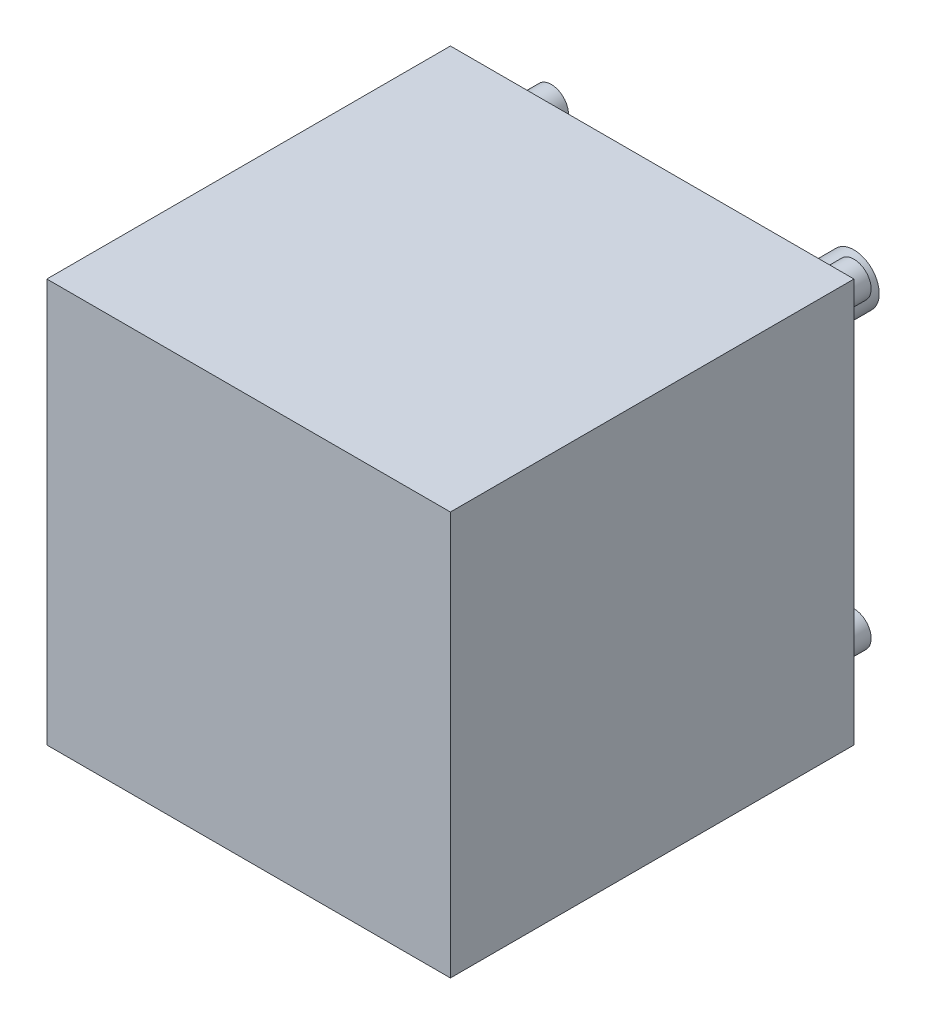
ISO-10303-21;
HEADER;
FILE_DESCRIPTION(('STEP AP214'),'2;1');
FILE_NAME('part.step','',(''),(''),'','','');
FILE_SCHEMA(('AUTOMOTIVE_DESIGN { 1 0 10303 214 1 1 1 1 }'));
ENDSEC;
DATA;
#1=APPLICATION_CONTEXT('core data for automotive mechanical design processes');
#2=APPLICATION_PROTOCOL_DEFINITION('international standard','automotive_design',2000,#1);
#3=PRODUCT_CONTEXT('',#1,'mechanical');
#4=PRODUCT('Part','Part','',(#3));
#5=PRODUCT_RELATED_PRODUCT_CATEGORY('part','',(#4));
#6=PRODUCT_DEFINITION_FORMATION('','',#4);
#7=PRODUCT_DEFINITION_CONTEXT('part definition',#1,'design');
#8=PRODUCT_DEFINITION('design','',#6,#7);
#9=PRODUCT_DEFINITION_SHAPE('','',#8);
#10=(LENGTH_UNIT() NAMED_UNIT(*) SI_UNIT(.MILLI.,.METRE.));
#11=(NAMED_UNIT(*) PLANE_ANGLE_UNIT() SI_UNIT($,.RADIAN.));
#12=(NAMED_UNIT(*) SI_UNIT($,.STERADIAN.) SOLID_ANGLE_UNIT());
#13=UNCERTAINTY_MEASURE_WITH_UNIT(LENGTH_MEASURE(1.E-05),#10,'distance_accuracy_value','');
#14=(GEOMETRIC_REPRESENTATION_CONTEXT(3) GLOBAL_UNCERTAINTY_ASSIGNED_CONTEXT((#13)) GLOBAL_UNIT_ASSIGNED_CONTEXT((#10,
#11,#12)) REPRESENTATION_CONTEXT('',''));
#15=CARTESIAN_POINT('',(0.,0.,0.));
#16=DIRECTION('',(0.,0.,1.));
#17=DIRECTION('',(1.,0.,0.));
#18=AXIS2_PLACEMENT_3D('',#15,#16,#17);
#19=CARTESIAN_POINT('',(20.,20.,0.));
#20=DIRECTION('',(0.,0.,-1.));
#21=DIRECTION('',(-1.,0.,0.));
#22=AXIS2_PLACEMENT_3D('',#19,#20,#21);
#23=PLANE('',#22);
#24=CARTESIAN_POINT('',(15.,15.,0.));
#25=DIRECTION('',(0.,0.,-1.));
#26=DIRECTION('',(1.,0.,0.));
#27=AXIS2_PLACEMENT_3D('',#24,#25,#26);
#28=CIRCLE('',#27,1.7);
#29=CARTESIAN_POINT('',(16.7,15.,0.));
#30=VERTEX_POINT('',#29);
#31=EDGE_CURVE('E138',#30,#30,#28,.T.);
#32=ORIENTED_EDGE('',*,*,#31,.F.);
#33=EDGE_LOOP('',(#32));
#34=FACE_BOUND('',#33,.T.);
#35=CARTESIAN_POINT('',(15.,-15.,0.));
#36=DIRECTION('',(0.,0.,-1.));
#37=DIRECTION('',(-1.,0.,0.));
#38=AXIS2_PLACEMENT_3D('',#35,#36,#37);
#39=CIRCLE('',#38,1.7);
#40=CARTESIAN_POINT('',(13.3,-15.,0.));
#41=VERTEX_POINT('',#40);
#42=EDGE_CURVE('E41',#41,#41,#39,.T.);
#43=ORIENTED_EDGE('',*,*,#42,.F.);
#44=EDGE_LOOP('',(#43));
#45=FACE_BOUND('',#44,.T.);
#46=DIRECTION('',(0.,1.,0.));
#47=VECTOR('',#46,1.);
#48=CARTESIAN_POINT('',(20.,-20.,0.));
#49=LINE('',#48,#47);
#50=CARTESIAN_POINT('',(20.,-20.,0.));
#51=VERTEX_POINT('',#50);
#52=CARTESIAN_POINT('',(20.,20.,0.));
#53=VERTEX_POINT('',#52);
#54=EDGE_CURVE('E100',#51,#53,#49,.T.);
#55=ORIENTED_EDGE('',*,*,#54,.F.);
#56=DIRECTION('',(1.,0.,0.));
#57=VECTOR('',#56,1.);
#58=CARTESIAN_POINT('',(-20.,-20.,0.));
#59=LINE('',#58,#57);
#60=CARTESIAN_POINT('',(-20.,-20.,0.));
#61=VERTEX_POINT('',#60);
#62=EDGE_CURVE('E72',#61,#51,#59,.T.);
#63=ORIENTED_EDGE('',*,*,#62,.F.);
#64=DIRECTION('',(0.,-1.,0.));
#65=VECTOR('',#64,1.);
#66=CARTESIAN_POINT('',(-20.,-20.,0.));
#67=LINE('',#66,#65);
#68=CARTESIAN_POINT('',(-20.,20.,0.));
#69=VERTEX_POINT('',#68);
#70=EDGE_CURVE('E66',#69,#61,#67,.T.);
#71=ORIENTED_EDGE('',*,*,#70,.F.);
#72=DIRECTION('',(-1.,0.,0.));
#73=VECTOR('',#72,1.);
#74=CARTESIAN_POINT('',(-20.,20.,0.));
#75=LINE('',#74,#73);
#76=EDGE_CURVE('E90',#53,#69,#75,.T.);
#77=ORIENTED_EDGE('',*,*,#76,.F.);
#78=EDGE_LOOP('',(#55,#63,#71,#77));
#79=FACE_BOUND('',#78,.T.);
#80=CARTESIAN_POINT('',(-15.,-15.,0.));
#81=DIRECTION('',(0.,0.,-1.));
#82=DIRECTION('',(-1.,0.,0.));
#83=AXIS2_PLACEMENT_3D('',#80,#81,#82);
#84=CIRCLE('',#83,1.7);
#85=CARTESIAN_POINT('',(-16.7,-15.,0.));
#86=VERTEX_POINT('',#85);
#87=EDGE_CURVE('E123',#86,#86,#84,.T.);
#88=ORIENTED_EDGE('',*,*,#87,.F.);
#89=EDGE_LOOP('',(#88));
#90=FACE_BOUND('',#89,.T.);
#91=CARTESIAN_POINT('',(-15.,15.,0.));
#92=DIRECTION('',(0.,0.,-1.));
#93=DIRECTION('',(-1.,0.,0.));
#94=AXIS2_PLACEMENT_3D('',#91,#92,#93);
#95=CIRCLE('',#94,1.7);
#96=CARTESIAN_POINT('',(-16.7,15.,0.));
#97=VERTEX_POINT('',#96);
#98=EDGE_CURVE('E11',#97,#97,#95,.T.);
#99=ORIENTED_EDGE('',*,*,#98,.F.);
#100=EDGE_LOOP('',(#99));
#101=FACE_BOUND('',#100,.T.);
#102=CARTESIAN_POINT('',(0.,0.,0.));
#103=DIRECTION('',(0.,0.,-1.));
#104=DIRECTION('',(-1.,0.,0.));
#105=AXIS2_PLACEMENT_3D('',#102,#103,#104);
#106=CIRCLE('',#105,2.5);
#107=CARTESIAN_POINT('',(-2.5,0.,0.));
#108=VERTEX_POINT('',#107);
#109=EDGE_CURVE('E128',#108,#108,#106,.T.);
#110=ORIENTED_EDGE('',*,*,#109,.F.);
#111=EDGE_LOOP('',(#110));
#112=FACE_BOUND('',#111,.T.);
#113=ADVANCED_FACE('F32',(#34,#45,#79,#90,#101,#112),#23,.T.);
#114=CARTESIAN_POINT('',(20.,-20.,40.));
#115=DIRECTION('',(-1.,0.,0.));
#116=DIRECTION('',(0.,0.,1.));
#117=AXIS2_PLACEMENT_3D('',#114,#115,#116);
#118=PLANE('',#117);
#119=ORIENTED_EDGE('',*,*,#54,.T.);
#120=DIRECTION('',(0.,0.,-1.));
#121=VECTOR('',#120,1.);
#122=CARTESIAN_POINT('',(20.,20.,40.));
#123=LINE('',#122,#121);
#124=CARTESIAN_POINT('',(20.,20.,40.));
#125=VERTEX_POINT('',#124);
#126=EDGE_CURVE('E91',#125,#53,#123,.T.);
#127=ORIENTED_EDGE('',*,*,#126,.F.);
#128=DIRECTION('',(0.,1.,0.));
#129=VECTOR('',#128,1.);
#130=CARTESIAN_POINT('',(20.,-20.,40.));
#131=LINE('',#130,#129);
#132=CARTESIAN_POINT('',(20.,-20.,40.));
#133=VERTEX_POINT('',#132);
#134=EDGE_CURVE('E85',#133,#125,#131,.T.);
#135=ORIENTED_EDGE('',*,*,#134,.F.);
#136=DIRECTION('',(0.,0.,-1.));
#137=VECTOR('',#136,1.);
#138=CARTESIAN_POINT('',(20.,-20.,40.));
#139=LINE('',#138,#137);
#140=EDGE_CURVE('E96',#133,#51,#139,.T.);
#141=ORIENTED_EDGE('',*,*,#140,.T.);
#142=EDGE_LOOP('',(#119,#127,#135,#141));
#143=FACE_BOUND('',#142,.T.);
#144=ADVANCED_FACE('F34',(#143),#118,.F.);
#145=CARTESIAN_POINT('',(-20.,20.,40.));
#146=DIRECTION('',(0.,-1.,0.));
#147=DIRECTION('',(0.,0.,-1.));
#148=AXIS2_PLACEMENT_3D('',#145,#146,#147);
#149=PLANE('',#148);
#150=ORIENTED_EDGE('',*,*,#76,.T.);
#151=DIRECTION('',(0.,0.,-1.));
#152=VECTOR('',#151,1.);
#153=CARTESIAN_POINT('',(-20.,20.,40.));
#154=LINE('',#153,#152);
#155=CARTESIAN_POINT('',(-20.,20.,40.));
#156=VERTEX_POINT('',#155);
#157=EDGE_CURVE('E88',#156,#69,#154,.T.);
#158=ORIENTED_EDGE('',*,*,#157,.F.);
#159=DIRECTION('',(-1.,0.,0.));
#160=VECTOR('',#159,1.);
#161=CARTESIAN_POINT('',(-20.,20.,40.));
#162=LINE('',#161,#160);
#163=EDGE_CURVE('E80',#125,#156,#162,.T.);
#164=ORIENTED_EDGE('',*,*,#163,.F.);
#165=ORIENTED_EDGE('',*,*,#126,.T.);
#166=EDGE_LOOP('',(#150,#158,#164,#165));
#167=FACE_BOUND('',#166,.T.);
#168=ADVANCED_FACE('F89',(#167),#149,.F.);
#169=CARTESIAN_POINT('',(-20.,-20.,40.));
#170=DIRECTION('',(1.,0.,0.));
#171=DIRECTION('',(0.,0.,-1.));
#172=AXIS2_PLACEMENT_3D('',#169,#170,#171);
#173=PLANE('',#172);
#174=ORIENTED_EDGE('',*,*,#70,.T.);
#175=DIRECTION('',(0.,0.,-1.));
#176=VECTOR('',#175,1.);
#177=CARTESIAN_POINT('',(-20.,-20.,40.));
#178=LINE('',#177,#176);
#179=CARTESIAN_POINT('',(-20.,-20.,40.));
#180=VERTEX_POINT('',#179);
#181=EDGE_CURVE('E92',#180,#61,#178,.T.);
#182=ORIENTED_EDGE('',*,*,#181,.F.);
#183=DIRECTION('',(0.,-1.,0.));
#184=VECTOR('',#183,1.);
#185=CARTESIAN_POINT('',(-20.,-20.,40.));
#186=LINE('',#185,#184);
#187=EDGE_CURVE('E83',#156,#180,#186,.T.);
#188=ORIENTED_EDGE('',*,*,#187,.F.);
#189=ORIENTED_EDGE('',*,*,#157,.T.);
#190=EDGE_LOOP('',(#174,#182,#188,#189));
#191=FACE_BOUND('',#190,.T.);
#192=ADVANCED_FACE('F94',(#191),#173,.F.);
#193=CARTESIAN_POINT('',(-20.,-20.,40.));
#194=DIRECTION('',(0.,1.,0.));
#195=DIRECTION('',(0.,0.,1.));
#196=AXIS2_PLACEMENT_3D('',#193,#194,#195);
#197=PLANE('',#196);
#198=ORIENTED_EDGE('',*,*,#62,.T.);
#199=ORIENTED_EDGE('',*,*,#140,.F.);
#200=DIRECTION('',(1.,0.,0.));
#201=VECTOR('',#200,1.);
#202=CARTESIAN_POINT('',(-20.,-20.,40.));
#203=LINE('',#202,#201);
#204=EDGE_CURVE('E49',#180,#133,#203,.T.);
#205=ORIENTED_EDGE('',*,*,#204,.F.);
#206=ORIENTED_EDGE('',*,*,#181,.T.);
#207=EDGE_LOOP('',(#198,#199,#205,#206));
#208=FACE_BOUND('',#207,.T.);
#209=ADVANCED_FACE('F162',(#208),#197,.F.);
#210=CARTESIAN_POINT('',(20.,20.,40.));
#211=DIRECTION('',(0.,0.,-1.));
#212=DIRECTION('',(-1.,0.,0.));
#213=AXIS2_PLACEMENT_3D('',#210,#211,#212);
#214=PLANE('',#213);
#215=ORIENTED_EDGE('',*,*,#134,.T.);
#216=ORIENTED_EDGE('',*,*,#163,.T.);
#217=ORIENTED_EDGE('',*,*,#187,.T.);
#218=ORIENTED_EDGE('',*,*,#204,.T.);
#219=EDGE_LOOP('',(#215,#216,#217,#218));
#220=FACE_BOUND('',#219,.T.);
#221=ADVANCED_FACE('F81',(#220),#214,.F.);
#222=CARTESIAN_POINT('',(-15.,-15.,-5.));
#223=DIRECTION('',(0.,0.,1.));
#224=DIRECTION('',(1.,0.,0.));
#225=AXIS2_PLACEMENT_3D('',#222,#223,#224);
#226=CYLINDRICAL_SURFACE('',#225,1.7);
#227=CARTESIAN_POINT('',(-15.,-15.,-5.));
#228=DIRECTION('',(0.,0.,-1.));
#229=DIRECTION('',(-1.,0.,0.));
#230=AXIS2_PLACEMENT_3D('',#227,#228,#229);
#231=CIRCLE('',#230,1.7);
#232=CARTESIAN_POINT('',(-16.7,-15.,-5.));
#233=VERTEX_POINT('',#232);
#234=EDGE_CURVE('E103',#233,#233,#231,.T.);
#235=ORIENTED_EDGE('',*,*,#234,.F.);
#236=EDGE_LOOP('',(#235));
#237=FACE_BOUND('',#236,.T.);
#238=ORIENTED_EDGE('',*,*,#87,.T.);
#239=EDGE_LOOP('',(#238));
#240=FACE_BOUND('',#239,.T.);
#241=ADVANCED_FACE('F150',(#237,#240),#226,.T.);
#242=CARTESIAN_POINT('',(-15.,-15.,-5.));
#243=DIRECTION('',(0.,0.,-1.));
#244=DIRECTION('',(-1.,0.,0.));
#245=AXIS2_PLACEMENT_3D('',#242,#243,#244);
#246=PLANE('',#245);
#247=ORIENTED_EDGE('',*,*,#234,.T.);
#248=EDGE_LOOP('',(#247));
#249=FACE_BOUND('',#248,.T.);
#250=ADVANCED_FACE('F152',(#249),#246,.T.);
#251=CARTESIAN_POINT('',(15.,-15.,-5.));
#252=DIRECTION('',(0.,0.,1.));
#253=DIRECTION('',(1.,0.,0.));
#254=AXIS2_PLACEMENT_3D('',#251,#252,#253);
#255=CYLINDRICAL_SURFACE('',#254,1.7);
#256=CARTESIAN_POINT('',(15.,-15.,-5.));
#257=DIRECTION('',(0.,0.,1.));
#258=DIRECTION('',(1.,0.,0.));
#259=AXIS2_PLACEMENT_3D('',#256,#257,#258);
#260=CIRCLE('',#259,1.7);
#261=CARTESIAN_POINT('',(16.7,-15.,-5.));
#262=VERTEX_POINT('',#261);
#263=EDGE_CURVE('E142',#262,#262,#260,.T.);
#264=ORIENTED_EDGE('',*,*,#263,.T.);
#265=EDGE_LOOP('',(#264));
#266=FACE_BOUND('',#265,.T.);
#267=ORIENTED_EDGE('',*,*,#42,.T.);
#268=EDGE_LOOP('',(#267));
#269=FACE_BOUND('',#268,.T.);
#270=ADVANCED_FACE('F112',(#266,#269),#255,.T.);
#271=CARTESIAN_POINT('',(15.,-15.,-5.));
#272=DIRECTION('',(0.,0.,-1.));
#273=DIRECTION('',(1.,0.,0.));
#274=AXIS2_PLACEMENT_3D('',#271,#272,#273);
#275=PLANE('',#274);
#276=ORIENTED_EDGE('',*,*,#263,.F.);
#277=EDGE_LOOP('',(#276));
#278=FACE_BOUND('',#277,.T.);
#279=ADVANCED_FACE('F218',(#278),#275,.T.);
#280=CARTESIAN_POINT('',(15.,15.,-5.));
#281=DIRECTION('',(0.,0.,1.));
#282=DIRECTION('',(1.,0.,0.));
#283=AXIS2_PLACEMENT_3D('',#280,#281,#282);
#284=CYLINDRICAL_SURFACE('',#283,1.7);
#285=CARTESIAN_POINT('',(15.,15.,-5.));
#286=DIRECTION('',(0.,0.,-1.));
#287=DIRECTION('',(1.,0.,0.));
#288=AXIS2_PLACEMENT_3D('',#285,#286,#287);
#289=CIRCLE('',#288,1.7);
#290=CARTESIAN_POINT('',(16.7,15.,-5.));
#291=VERTEX_POINT('',#290);
#292=EDGE_CURVE('E139',#291,#291,#289,.T.);
#293=ORIENTED_EDGE('',*,*,#292,.F.);
#294=EDGE_LOOP('',(#293));
#295=FACE_BOUND('',#294,.T.);
#296=ORIENTED_EDGE('',*,*,#31,.T.);
#297=EDGE_LOOP('',(#296));
#298=FACE_BOUND('',#297,.T.);
#299=ADVANCED_FACE('F227',(#295,#298),#284,.T.);
#300=CARTESIAN_POINT('',(15.,15.,-5.));
#301=DIRECTION('',(0.,0.,-1.));
#302=DIRECTION('',(1.,0.,0.));
#303=AXIS2_PLACEMENT_3D('',#300,#301,#302);
#304=PLANE('',#303);
#305=ORIENTED_EDGE('',*,*,#292,.T.);
#306=EDGE_LOOP('',(#305));
#307=FACE_BOUND('',#306,.T.);
#308=ADVANCED_FACE('F237',(#307),#304,.T.);
#309=CARTESIAN_POINT('',(-15.,15.,-5.));
#310=DIRECTION('',(0.,0.,1.));
#311=DIRECTION('',(1.,0.,0.));
#312=AXIS2_PLACEMENT_3D('',#309,#310,#311);
#313=CYLINDRICAL_SURFACE('',#312,1.7);
#314=CARTESIAN_POINT('',(-15.,15.,-5.));
#315=DIRECTION('',(0.,0.,1.));
#316=DIRECTION('',(-1.,0.,0.));
#317=AXIS2_PLACEMENT_3D('',#314,#315,#316);
#318=CIRCLE('',#317,1.7);
#319=CARTESIAN_POINT('',(-16.7,15.,-5.));
#320=VERTEX_POINT('',#319);
#321=EDGE_CURVE('E133',#320,#320,#318,.T.);
#322=ORIENTED_EDGE('',*,*,#321,.T.);
#323=EDGE_LOOP('',(#322));
#324=FACE_BOUND('',#323,.T.);
#325=ORIENTED_EDGE('',*,*,#98,.T.);
#326=EDGE_LOOP('',(#325));
#327=FACE_BOUND('',#326,.T.);
#328=ADVANCED_FACE('F247',(#324,#327),#313,.T.);
#329=CARTESIAN_POINT('',(-15.,15.,-5.));
#330=DIRECTION('',(0.,0.,-1.));
#331=DIRECTION('',(-1.,0.,0.));
#332=AXIS2_PLACEMENT_3D('',#329,#330,#331);
#333=PLANE('',#332);
#334=ORIENTED_EDGE('',*,*,#321,.F.);
#335=EDGE_LOOP('',(#334));
#336=FACE_BOUND('',#335,.T.);
#337=ADVANCED_FACE('F257',(#336),#333,.T.);
#338=CARTESIAN_POINT('',(0.,0.,-20.));
#339=DIRECTION('',(0.,0.,1.));
#340=DIRECTION('',(1.,0.,0.));
#341=AXIS2_PLACEMENT_3D('',#338,#339,#340);
#342=CYLINDRICAL_SURFACE('',#341,2.5);
#343=CARTESIAN_POINT('',(0.,0.,-20.));
#344=DIRECTION('',(0.,0.,-1.));
#345=DIRECTION('',(-1.,0.,0.));
#346=AXIS2_PLACEMENT_3D('',#343,#344,#345);
#347=CIRCLE('',#346,2.5);
#348=CARTESIAN_POINT('',(-2.5,0.,-20.));
#349=VERTEX_POINT('',#348);
#350=EDGE_CURVE('E130',#349,#349,#347,.T.);
#351=ORIENTED_EDGE('',*,*,#350,.F.);
#352=EDGE_LOOP('',(#351));
#353=FACE_BOUND('',#352,.T.);
#354=ORIENTED_EDGE('',*,*,#109,.T.);
#355=EDGE_LOOP('',(#354));
#356=FACE_BOUND('',#355,.T.);
#357=ADVANCED_FACE('F266',(#353,#356),#342,.T.);
#358=CARTESIAN_POINT('',(0.,0.,-20.));
#359=DIRECTION('',(0.,0.,-1.));
#360=DIRECTION('',(-1.,0.,0.));
#361=AXIS2_PLACEMENT_3D('',#358,#359,#360);
#362=PLANE('',#361);
#363=ORIENTED_EDGE('',*,*,#350,.T.);
#364=EDGE_LOOP('',(#363));
#365=FACE_BOUND('',#364,.T.);
#366=ADVANCED_FACE('F281',(#365),#362,.T.);
#367=CLOSED_SHELL('',(#113,#144,#168,#192,#209,#221,#241,#250,#270,#279,#299,#308,#328,#337,
#357,#366));
#368=MANIFOLD_SOLID_BREP('B2',#367);
#369=ADVANCED_BREP_SHAPE_REPRESENTATION('',(#18,#368),#14);
#370=SHAPE_DEFINITION_REPRESENTATION(#9,#369);
ENDSEC;
END-ISO-10303-21;
